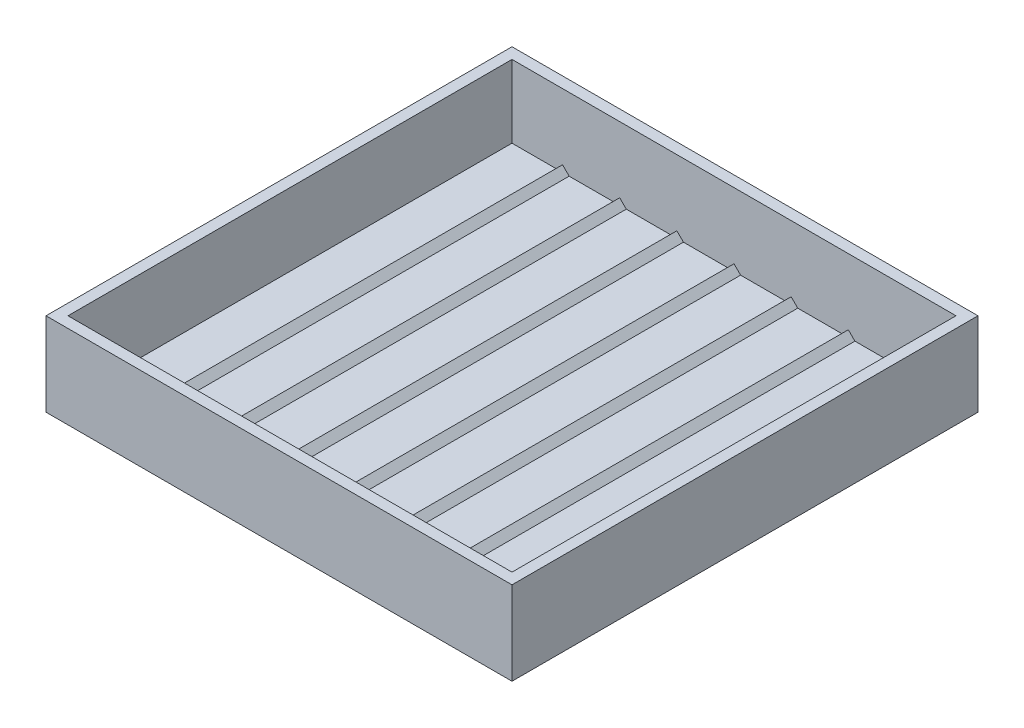
ISO-10303-21;
HEADER;
FILE_DESCRIPTION(('STEP AP214'),'2;1');
FILE_NAME('part.step','',(''),(''),'','','');
FILE_SCHEMA(('AUTOMOTIVE_DESIGN { 1 0 10303 214 1 1 1 1 }'));
ENDSEC;
DATA;
#1=APPLICATION_CONTEXT('core data for automotive mechanical design processes');
#2=APPLICATION_PROTOCOL_DEFINITION('international standard','automotive_design',2000,#1);
#3=PRODUCT_CONTEXT('',#1,'mechanical');
#4=PRODUCT('Part','Part','',(#3));
#5=PRODUCT_RELATED_PRODUCT_CATEGORY('part','',(#4));
#6=PRODUCT_DEFINITION_FORMATION('','',#4);
#7=PRODUCT_DEFINITION_CONTEXT('part definition',#1,'design');
#8=PRODUCT_DEFINITION('design','',#6,#7);
#9=PRODUCT_DEFINITION_SHAPE('','',#8);
#10=(LENGTH_UNIT() NAMED_UNIT(*) SI_UNIT(.MILLI.,.METRE.));
#11=(NAMED_UNIT(*) PLANE_ANGLE_UNIT() SI_UNIT($,.RADIAN.));
#12=(NAMED_UNIT(*) SI_UNIT($,.STERADIAN.) SOLID_ANGLE_UNIT());
#13=UNCERTAINTY_MEASURE_WITH_UNIT(LENGTH_MEASURE(1.E-05),#10,'distance_accuracy_value','');
#14=(GEOMETRIC_REPRESENTATION_CONTEXT(3) GLOBAL_UNCERTAINTY_ASSIGNED_CONTEXT((#13)) GLOBAL_UNIT_ASSIGNED_CONTEXT((#10,
#11,#12)) REPRESENTATION_CONTEXT('',''));
#15=CARTESIAN_POINT('',(0.,0.,0.));
#16=DIRECTION('',(0.,0.,1.));
#17=DIRECTION('',(1.,0.,0.));
#18=AXIS2_PLACEMENT_3D('',#15,#16,#17);
#19=CARTESIAN_POINT('',(0.,0.,0.));
#20=DIRECTION('',(0.,0.,1.));
#21=DIRECTION('',(1.,0.,0.));
#22=AXIS2_PLACEMENT_3D('',#19,#20,#21);
#23=PLANE('',#22);
#24=DIRECTION('',(1.,0.,0.));
#25=VECTOR('',#24,1.);
#26=CARTESIAN_POINT('',(0.,-7.00000000000003,0.));
#27=LINE('',#26,#25);
#28=CARTESIAN_POINT('',(40.5,-7.00000000000001,0.));
#29=VERTEX_POINT('',#28);
#30=CARTESIAN_POINT('',(50.5,-7.,0.));
#31=VERTEX_POINT('',#30);
#32=EDGE_CURVE('E50',#29,#31,#27,.T.);
#33=ORIENTED_EDGE('',*,*,#32,.T.);
#34=DIRECTION('',(0.,1.,0.));
#35=VECTOR('',#34,1.);
#36=CARTESIAN_POINT('',(50.5,0.,0.));
#37=LINE('',#36,#35);
#38=CARTESIAN_POINT('',(50.5,9.50000000000001,0.));
#39=VERTEX_POINT('',#38);
#40=EDGE_CURVE('E385',#31,#39,#37,.T.);
#41=ORIENTED_EDGE('',*,*,#40,.T.);
#42=DIRECTION('',(-1.,0.,0.));
#43=VECTOR('',#42,1.);
#44=CARTESIAN_POINT('',(0.,9.5,0.));
#45=LINE('',#44,#43);
#46=CARTESIAN_POINT('',(-50.5,9.49999999999999,0.));
#47=VERTEX_POINT('',#46);
#48=EDGE_CURVE('E454',#39,#47,#45,.T.);
#49=ORIENTED_EDGE('',*,*,#48,.T.);
#50=DIRECTION('',(0.,1.,0.));
#51=VECTOR('',#50,1.);
#52=CARTESIAN_POINT('',(-50.5,0.,0.));
#53=LINE('',#52,#51);
#54=CARTESIAN_POINT('',(-50.5,-7.00000000000001,0.));
#55=VERTEX_POINT('',#54);
#56=EDGE_CURVE('E382',#55,#47,#53,.T.);
#57=ORIENTED_EDGE('',*,*,#56,.F.);
#58=DIRECTION('',(1.,0.,0.));
#59=VECTOR('',#58,1.);
#60=CARTESIAN_POINT('',(0.,-7.00000000000001,0.));
#61=LINE('',#60,#59);
#62=CARTESIAN_POINT('',(-40.5,-7.00000000000001,0.));
#63=VERTEX_POINT('',#62);
#64=EDGE_CURVE('E380',#55,#63,#61,.T.);
#65=ORIENTED_EDGE('',*,*,#64,.T.);
#66=DIRECTION('',(-0.707106781186546,-0.707106781186549,0.));
#67=VECTOR('',#66,1.);
#68=CARTESIAN_POINT('',(-16.7500000000001,16.75,0.));
#69=LINE('',#68,#67);
#70=CARTESIAN_POINT('',(-39.,-5.50000000000001,0.));
#71=VERTEX_POINT('',#70);
#72=EDGE_CURVE('E377',#71,#63,#69,.T.);
#73=ORIENTED_EDGE('',*,*,#72,.F.);
#74=DIRECTION('',(-0.707106781186549,0.707106781186546,0.));
#75=VECTOR('',#74,1.);
#76=CARTESIAN_POINT('',(-22.2499999999999,-22.25,0.));
#77=LINE('',#76,#75);
#78=CARTESIAN_POINT('',(-37.5,-7.00000000000001,0.));
#79=VERTEX_POINT('',#78);
#80=EDGE_CURVE('E374',#79,#71,#77,.T.);
#81=ORIENTED_EDGE('',*,*,#80,.F.);
#82=DIRECTION('',(1.,0.,0.));
#83=VECTOR('',#82,1.);
#84=CARTESIAN_POINT('',(0.,-7.00000000000001,0.));
#85=LINE('',#84,#83);
#86=CARTESIAN_POINT('',(-27.5,-7.00000000000001,0.));
#87=VERTEX_POINT('',#86);
#88=EDGE_CURVE('E372',#79,#87,#85,.T.);
#89=ORIENTED_EDGE('',*,*,#88,.T.);
#90=DIRECTION('',(-0.707106781186546,-0.707106781186549,0.));
#91=VECTOR('',#90,1.);
#92=CARTESIAN_POINT('',(-10.2500000000001,10.25,0.));
#93=LINE('',#92,#91);
#94=CARTESIAN_POINT('',(-26.,-5.50000000000001,0.));
#95=VERTEX_POINT('',#94);
#96=EDGE_CURVE('E369',#95,#87,#93,.T.);
#97=ORIENTED_EDGE('',*,*,#96,.F.);
#98=DIRECTION('',(-0.707106781186549,0.707106781186546,0.));
#99=VECTOR('',#98,1.);
#100=CARTESIAN_POINT('',(-15.7499999999999,-15.75,0.));
#101=LINE('',#100,#99);
#102=CARTESIAN_POINT('',(-24.5,-7.,0.));
#103=VERTEX_POINT('',#102);
#104=EDGE_CURVE('E366',#103,#95,#101,.T.);
#105=ORIENTED_EDGE('',*,*,#104,.F.);
#106=DIRECTION('',(1.,0.,0.));
#107=VECTOR('',#106,1.);
#108=CARTESIAN_POINT('',(0.,-7.00000000000001,0.));
#109=LINE('',#108,#107);
#110=CARTESIAN_POINT('',(-14.5,-7.00000000000001,0.));
#111=VERTEX_POINT('',#110);
#112=EDGE_CURVE('E364',#103,#111,#109,.T.);
#113=ORIENTED_EDGE('',*,*,#112,.T.);
#114=DIRECTION('',(-0.707106781186546,-0.707106781186549,0.));
#115=VECTOR('',#114,1.);
#116=CARTESIAN_POINT('',(-3.75000000000003,3.75000000000001,0.));
#117=LINE('',#116,#115);
#118=CARTESIAN_POINT('',(-13.,-5.50000000000001,0.));
#119=VERTEX_POINT('',#118);
#120=EDGE_CURVE('E361',#119,#111,#117,.T.);
#121=ORIENTED_EDGE('',*,*,#120,.F.);
#122=DIRECTION('',(-0.707106781186549,0.707106781186546,0.));
#123=VECTOR('',#122,1.);
#124=CARTESIAN_POINT('',(-9.24999999999997,-9.25000000000002,0.));
#125=LINE('',#124,#123);
#126=CARTESIAN_POINT('',(-11.5,-7.00000000000001,0.));
#127=VERTEX_POINT('',#126);
#128=EDGE_CURVE('E358',#127,#119,#125,.T.);
#129=ORIENTED_EDGE('',*,*,#128,.F.);
#130=DIRECTION('',(1.,0.,0.));
#131=VECTOR('',#130,1.);
#132=CARTESIAN_POINT('',(0.,-7.00000000000001,0.));
#133=LINE('',#132,#131);
#134=CARTESIAN_POINT('',(-1.5,-7.00000000000001,0.));
#135=VERTEX_POINT('',#134);
#136=EDGE_CURVE('E356',#127,#135,#133,.T.);
#137=ORIENTED_EDGE('',*,*,#136,.T.);
#138=DIRECTION('',(-0.707106781186546,-0.707106781186549,0.));
#139=VECTOR('',#138,1.);
#140=CARTESIAN_POINT('',(2.75,-2.74999999999999,0.));
#141=LINE('',#140,#139);
#142=CARTESIAN_POINT('',(0.,-5.50000000000001,0.));
#143=VERTEX_POINT('',#142);
#144=EDGE_CURVE('E353',#143,#135,#141,.T.);
#145=ORIENTED_EDGE('',*,*,#144,.F.);
#146=DIRECTION('',(-0.707106781186549,0.707106781186546,0.));
#147=VECTOR('',#146,1.);
#148=CARTESIAN_POINT('',(-2.75,-2.75000000000002,0.));
#149=LINE('',#148,#147);
#150=CARTESIAN_POINT('',(1.5,-7.00000000000001,0.));
#151=VERTEX_POINT('',#150);
#152=EDGE_CURVE('E350',#151,#143,#149,.T.);
#153=ORIENTED_EDGE('',*,*,#152,.F.);
#154=DIRECTION('',(1.,0.,0.));
#155=VECTOR('',#154,1.);
#156=CARTESIAN_POINT('',(0.,-7.00000000000001,0.));
#157=LINE('',#156,#155);
#158=CARTESIAN_POINT('',(11.5,-7.00000000000001,0.));
#159=VERTEX_POINT('',#158);
#160=EDGE_CURVE('E348',#151,#159,#157,.T.);
#161=ORIENTED_EDGE('',*,*,#160,.T.);
#162=DIRECTION('',(-0.707106781186546,-0.707106781186549,0.));
#163=VECTOR('',#162,1.);
#164=CARTESIAN_POINT('',(9.25000000000003,-9.24999999999999,0.));
#165=LINE('',#164,#163);
#166=CARTESIAN_POINT('',(13.,-5.50000000000001,0.));
#167=VERTEX_POINT('',#166);
#168=EDGE_CURVE('E345',#167,#159,#165,.T.);
#169=ORIENTED_EDGE('',*,*,#168,.F.);
#170=DIRECTION('',(-0.707106781186549,0.707106781186546,0.));
#171=VECTOR('',#170,1.);
#172=CARTESIAN_POINT('',(3.74999999999996,3.74999999999998,0.));
#173=LINE('',#172,#171);
#174=CARTESIAN_POINT('',(14.5,-7.00000000000001,0.));
#175=VERTEX_POINT('',#174);
#176=EDGE_CURVE('E342',#175,#167,#173,.T.);
#177=ORIENTED_EDGE('',*,*,#176,.F.);
#178=DIRECTION('',(1.,0.,0.));
#179=VECTOR('',#178,1.);
#180=CARTESIAN_POINT('',(0.,-7.00000000000001,0.));
#181=LINE('',#180,#179);
#182=CARTESIAN_POINT('',(24.5,-7.00000000000001,0.));
#183=VERTEX_POINT('',#182);
#184=EDGE_CURVE('E340',#175,#183,#181,.T.);
#185=ORIENTED_EDGE('',*,*,#184,.T.);
#186=DIRECTION('',(-0.707106781186546,-0.707106781186549,0.));
#187=VECTOR('',#186,1.);
#188=CARTESIAN_POINT('',(15.7500000000001,-15.75,0.));
#189=LINE('',#188,#187);
#190=CARTESIAN_POINT('',(26.,-5.50000000000001,0.));
#191=VERTEX_POINT('',#190);
#192=EDGE_CURVE('E337',#191,#183,#189,.T.);
#193=ORIENTED_EDGE('',*,*,#192,.F.);
#194=DIRECTION('',(-0.707106781186549,0.707106781186546,0.));
#195=VECTOR('',#194,1.);
#196=CARTESIAN_POINT('',(10.2499999999999,10.25,0.));
#197=LINE('',#196,#195);
#198=CARTESIAN_POINT('',(27.5,-7.00000000000001,0.));
#199=VERTEX_POINT('',#198);
#200=EDGE_CURVE('E334',#199,#191,#197,.T.);
#201=ORIENTED_EDGE('',*,*,#200,.F.);
#202=DIRECTION('',(1.,0.,0.));
#203=VECTOR('',#202,1.);
#204=CARTESIAN_POINT('',(0.,-7.00000000000001,0.));
#205=LINE('',#204,#203);
#206=CARTESIAN_POINT('',(37.5,-7.00000000000001,0.));
#207=VERTEX_POINT('',#206);
#208=EDGE_CURVE('E332',#199,#207,#205,.T.);
#209=ORIENTED_EDGE('',*,*,#208,.T.);
#210=DIRECTION('',(-0.707106781186546,-0.707106781186549,0.));
#211=VECTOR('',#210,1.);
#212=CARTESIAN_POINT('',(22.2500000000001,-22.25,0.));
#213=LINE('',#212,#211);
#214=CARTESIAN_POINT('',(39.,-5.5,0.));
#215=VERTEX_POINT('',#214);
#216=EDGE_CURVE('E232',#215,#207,#213,.T.);
#217=ORIENTED_EDGE('',*,*,#216,.F.);
#218=DIRECTION('',(-0.707106781186549,0.707106781186546,0.));
#219=VECTOR('',#218,1.);
#220=CARTESIAN_POINT('',(16.7499999999999,16.75,0.));
#221=LINE('',#220,#219);
#222=EDGE_CURVE('E55',#29,#215,#221,.T.);
#223=ORIENTED_EDGE('',*,*,#222,.F.);
#224=EDGE_LOOP('',(#33,#41,#49,#57,#65,#73,#81,#89,#97,#105,#113,#121,#129,#137,#145,#153,#161,
#169,#177,#185,#193,#201,#209,#217,#223));
#225=FACE_BOUND('',#224,.T.);
#226=ADVANCED_FACE('F33',(#225),#23,.T.);
#227=CARTESIAN_POINT('',(53.,0.,-2.5));
#228=DIRECTION('',(1.,0.,0.));
#229=DIRECTION('',(0.,0.,-1.));
#230=AXIS2_PLACEMENT_3D('',#227,#228,#229);
#231=PLANE('',#230);
#232=DIRECTION('',(0.,0.,1.));
#233=VECTOR('',#232,1.);
#234=CARTESIAN_POINT('',(53.,9.50000000000001,-2.5));
#235=LINE('',#234,#233);
#236=CARTESIAN_POINT('',(53.,9.50000000000001,-2.5));
#237=VERTEX_POINT('',#236);
#238=CARTESIAN_POINT('',(53.,9.50000000000001,103.5));
#239=VERTEX_POINT('',#238);
#240=EDGE_CURVE('E37',#237,#239,#235,.T.);
#241=ORIENTED_EDGE('',*,*,#240,.T.);
#242=DIRECTION('',(0.,1.,0.));
#243=VECTOR('',#242,1.);
#244=CARTESIAN_POINT('',(53.,0.,103.5));
#245=LINE('',#244,#243);
#246=CARTESIAN_POINT('',(53.,-9.49999999999999,103.5));
#247=VERTEX_POINT('',#246);
#248=EDGE_CURVE('E316',#247,#239,#245,.T.);
#249=ORIENTED_EDGE('',*,*,#248,.F.);
#250=DIRECTION('',(0.,0.,1.));
#251=VECTOR('',#250,1.);
#252=CARTESIAN_POINT('',(53.,-9.49999999999999,-2.5));
#253=LINE('',#252,#251);
#254=CARTESIAN_POINT('',(53.,-9.49999999999999,-2.5));
#255=VERTEX_POINT('',#254);
#256=EDGE_CURVE('E11',#255,#247,#253,.T.);
#257=ORIENTED_EDGE('',*,*,#256,.F.);
#258=DIRECTION('',(0.,1.,0.));
#259=VECTOR('',#258,1.);
#260=CARTESIAN_POINT('',(53.,0.,-2.5));
#261=LINE('',#260,#259);
#262=EDGE_CURVE('E455',#255,#237,#261,.T.);
#263=ORIENTED_EDGE('',*,*,#262,.T.);
#264=EDGE_LOOP('',(#241,#249,#257,#263));
#265=FACE_BOUND('',#264,.T.);
#266=ADVANCED_FACE('F35',(#265),#231,.T.);
#267=CARTESIAN_POINT('',(0.,-9.5,-2.5));
#268=DIRECTION('',(0.,1.,0.));
#269=DIRECTION('',(-1.,0.,0.));
#270=AXIS2_PLACEMENT_3D('',#267,#268,#269);
#271=PLANE('',#270);
#272=ORIENTED_EDGE('',*,*,#256,.T.);
#273=DIRECTION('',(-1.,0.,0.));
#274=VECTOR('',#273,1.);
#275=CARTESIAN_POINT('',(0.,-9.5,103.5));
#276=LINE('',#275,#274);
#277=CARTESIAN_POINT('',(-53.,-9.50000000000001,103.5));
#278=VERTEX_POINT('',#277);
#279=EDGE_CURVE('E325',#247,#278,#276,.T.);
#280=ORIENTED_EDGE('',*,*,#279,.T.);
#281=DIRECTION('',(0.,0.,1.));
#282=VECTOR('',#281,1.);
#283=CARTESIAN_POINT('',(-53.,-9.50000000000001,-2.5));
#284=LINE('',#283,#282);
#285=CARTESIAN_POINT('',(-53.,-9.50000000000001,-2.5));
#286=VERTEX_POINT('',#285);
#287=EDGE_CURVE('E42',#286,#278,#284,.T.);
#288=ORIENTED_EDGE('',*,*,#287,.F.);
#289=DIRECTION('',(-1.,0.,0.));
#290=VECTOR('',#289,1.);
#291=CARTESIAN_POINT('',(0.,-9.5,-2.5));
#292=LINE('',#291,#290);
#293=EDGE_CURVE('E463',#255,#286,#292,.T.);
#294=ORIENTED_EDGE('',*,*,#293,.F.);
#295=EDGE_LOOP('',(#272,#280,#288,#294));
#296=FACE_BOUND('',#295,.T.);
#297=ADVANCED_FACE('F482',(#296),#271,.F.);
#298=CARTESIAN_POINT('',(-53.,0.,-2.5));
#299=DIRECTION('',(1.,0.,0.));
#300=DIRECTION('',(0.,0.,-1.));
#301=AXIS2_PLACEMENT_3D('',#298,#299,#300);
#302=PLANE('',#301);
#303=ORIENTED_EDGE('',*,*,#287,.T.);
#304=DIRECTION('',(0.,1.,0.));
#305=VECTOR('',#304,1.);
#306=CARTESIAN_POINT('',(-53.,0.,103.5));
#307=LINE('',#306,#305);
#308=CARTESIAN_POINT('',(-53.,9.49999999999999,103.5));
#309=VERTEX_POINT('',#308);
#310=EDGE_CURVE('E322',#278,#309,#307,.T.);
#311=ORIENTED_EDGE('',*,*,#310,.T.);
#312=DIRECTION('',(0.,0.,1.));
#313=VECTOR('',#312,1.);
#314=CARTESIAN_POINT('',(-53.,9.49999999999999,-2.5));
#315=LINE('',#314,#313);
#316=CARTESIAN_POINT('',(-53.,9.49999999999999,-2.5));
#317=VERTEX_POINT('',#316);
#318=EDGE_CURVE('E466',#317,#309,#315,.T.);
#319=ORIENTED_EDGE('',*,*,#318,.F.);
#320=DIRECTION('',(0.,1.,0.));
#321=VECTOR('',#320,1.);
#322=CARTESIAN_POINT('',(-53.,0.,-2.5));
#323=LINE('',#322,#321);
#324=EDGE_CURVE('E461',#286,#317,#323,.T.);
#325=ORIENTED_EDGE('',*,*,#324,.F.);
#326=EDGE_LOOP('',(#303,#311,#319,#325));
#327=FACE_BOUND('',#326,.T.);
#328=ADVANCED_FACE('F488',(#327),#302,.F.);
#329=CARTESIAN_POINT('',(0.,9.5,-2.5));
#330=DIRECTION('',(0.,1.,0.));
#331=DIRECTION('',(-1.,0.,0.));
#332=AXIS2_PLACEMENT_3D('',#329,#330,#331);
#333=PLANE('',#332);
#334=ORIENTED_EDGE('',*,*,#318,.T.);
#335=DIRECTION('',(-1.,0.,0.));
#336=VECTOR('',#335,1.);
#337=CARTESIAN_POINT('',(0.,9.5,103.5));
#338=LINE('',#337,#336);
#339=EDGE_CURVE('E319',#239,#309,#338,.T.);
#340=ORIENTED_EDGE('',*,*,#339,.F.);
#341=ORIENTED_EDGE('',*,*,#240,.F.);
#342=DIRECTION('',(-1.,0.,0.));
#343=VECTOR('',#342,1.);
#344=CARTESIAN_POINT('',(0.,9.5,-2.5));
#345=LINE('',#344,#343);
#346=EDGE_CURVE('E458',#237,#317,#345,.T.);
#347=ORIENTED_EDGE('',*,*,#346,.T.);
#348=EDGE_LOOP('',(#334,#340,#341,#347));
#349=FACE_BOUND('',#348,.T.);
#350=ORIENTED_EDGE('',*,*,#48,.F.);
#351=DIRECTION('',(0.,0.,-1.));
#352=VECTOR('',#351,1.);
#353=CARTESIAN_POINT('',(50.5,9.50000000000001,50.5));
#354=LINE('',#353,#352);
#355=CARTESIAN_POINT('',(50.5,9.50000000000001,101.));
#356=VERTEX_POINT('',#355);
#357=EDGE_CURVE('E392',#356,#39,#354,.T.);
#358=ORIENTED_EDGE('',*,*,#357,.F.);
#359=DIRECTION('',(-1.,0.,0.));
#360=VECTOR('',#359,1.);
#361=CARTESIAN_POINT('',(0.,9.5,101.));
#362=LINE('',#361,#360);
#363=CARTESIAN_POINT('',(-50.5,9.49999999999999,101.));
#364=VERTEX_POINT('',#363);
#365=EDGE_CURVE('E315',#356,#364,#362,.T.);
#366=ORIENTED_EDGE('',*,*,#365,.T.);
#367=DIRECTION('',(0.,0.,-1.));
#368=VECTOR('',#367,1.);
#369=CARTESIAN_POINT('',(-50.5,9.49999999999999,50.5));
#370=LINE('',#369,#368);
#371=EDGE_CURVE('E395',#364,#47,#370,.T.);
#372=ORIENTED_EDGE('',*,*,#371,.T.);
#373=EDGE_LOOP('',(#350,#358,#366,#372));
#374=FACE_BOUND('',#373,.T.);
#375=ADVANCED_FACE('F474',(#349,#374),#333,.T.);
#376=CARTESIAN_POINT('',(0.,0.,-2.5));
#377=DIRECTION('',(0.,0.,1.));
#378=DIRECTION('',(1.,0.,0.));
#379=AXIS2_PLACEMENT_3D('',#376,#377,#378);
#380=PLANE('',#379);
#381=ORIENTED_EDGE('',*,*,#262,.F.);
#382=ORIENTED_EDGE('',*,*,#293,.T.);
#383=ORIENTED_EDGE('',*,*,#324,.T.);
#384=ORIENTED_EDGE('',*,*,#346,.F.);
#385=EDGE_LOOP('',(#381,#382,#383,#384));
#386=FACE_BOUND('',#385,.T.);
#387=ADVANCED_FACE('F486',(#386),#380,.F.);
#388=CARTESIAN_POINT('',(16.7499999999999,16.75,50.5));
#389=DIRECTION('',(-0.707106781186546,-0.707106781186549,0.));
#390=DIRECTION('',(0.707106781186549,-0.707106781186546,0.));
#391=AXIS2_PLACEMENT_3D('',#388,#389,#390);
#392=PLANE('',#391);
#393=ORIENTED_EDGE('',*,*,#222,.T.);
#394=DIRECTION('',(0.,0.,-1.));
#395=VECTOR('',#394,1.);
#396=CARTESIAN_POINT('',(39.,-5.5,50.5));
#397=LINE('',#396,#395);
#398=CARTESIAN_POINT('',(39.,-5.5,101.));
#399=VERTEX_POINT('',#398);
#400=EDGE_CURVE('E235',#399,#215,#397,.T.);
#401=ORIENTED_EDGE('',*,*,#400,.F.);
#402=DIRECTION('',(-0.707106781186549,0.707106781186546,0.));
#403=VECTOR('',#402,1.);
#404=CARTESIAN_POINT('',(16.7499999999999,16.75,101.));
#405=LINE('',#404,#403);
#406=CARTESIAN_POINT('',(40.5,-7.00000000000001,101.));
#407=VERTEX_POINT('',#406);
#408=EDGE_CURVE('E250',#407,#399,#405,.T.);
#409=ORIENTED_EDGE('',*,*,#408,.F.);
#410=DIRECTION('',(0.,0.,-1.));
#411=VECTOR('',#410,1.);
#412=CARTESIAN_POINT('',(40.5,-7.00000000000001,50.5));
#413=LINE('',#412,#411);
#414=EDGE_CURVE('E388',#407,#29,#413,.T.);
#415=ORIENTED_EDGE('',*,*,#414,.T.);
#416=EDGE_LOOP('',(#393,#401,#409,#415));
#417=FACE_BOUND('',#416,.T.);
#418=ADVANCED_FACE('F504',(#417),#392,.F.);
#419=CARTESIAN_POINT('',(22.2500000000001,-22.25,50.5));
#420=DIRECTION('',(0.707106781186549,-0.707106781186546,0.));
#421=DIRECTION('',(0.707106781186546,0.707106781186549,0.));
#422=AXIS2_PLACEMENT_3D('',#419,#420,#421);
#423=PLANE('',#422);
#424=ORIENTED_EDGE('',*,*,#216,.T.);
#425=DIRECTION('',(0.,0.,-1.));
#426=VECTOR('',#425,1.);
#427=CARTESIAN_POINT('',(37.5,-7.00000000000001,50.5));
#428=LINE('',#427,#426);
#429=CARTESIAN_POINT('',(37.5,-7.00000000000001,101.));
#430=VERTEX_POINT('',#429);
#431=EDGE_CURVE('E225',#430,#207,#428,.T.);
#432=ORIENTED_EDGE('',*,*,#431,.F.);
#433=DIRECTION('',(-0.707106781186546,-0.707106781186549,0.));
#434=VECTOR('',#433,1.);
#435=CARTESIAN_POINT('',(22.2500000000001,-22.25,101.));
#436=LINE('',#435,#434);
#437=EDGE_CURVE('E230',#399,#430,#436,.T.);
#438=ORIENTED_EDGE('',*,*,#437,.F.);
#439=ORIENTED_EDGE('',*,*,#400,.T.);
#440=EDGE_LOOP('',(#424,#432,#438,#439));
#441=FACE_BOUND('',#440,.T.);
#442=ADVANCED_FACE('F227',(#441),#423,.F.);
#443=CARTESIAN_POINT('',(0.,-7.00000000000001,50.5));
#444=DIRECTION('',(0.,1.,0.));
#445=DIRECTION('',(-1.,0.,0.));
#446=AXIS2_PLACEMENT_3D('',#443,#444,#445);
#447=PLANE('',#446);
#448=ORIENTED_EDGE('',*,*,#208,.F.);
#449=DIRECTION('',(0.,0.,-1.));
#450=VECTOR('',#449,1.);
#451=CARTESIAN_POINT('',(27.5,-7.00000000000001,50.5));
#452=LINE('',#451,#450);
#453=CARTESIAN_POINT('',(27.5,-7.00000000000001,101.));
#454=VERTEX_POINT('',#453);
#455=EDGE_CURVE('E236',#454,#199,#452,.T.);
#456=ORIENTED_EDGE('',*,*,#455,.F.);
#457=DIRECTION('',(1.,0.,0.));
#458=VECTOR('',#457,1.);
#459=CARTESIAN_POINT('',(0.,-7.00000000000001,101.));
#460=LINE('',#459,#458);
#461=EDGE_CURVE('E239',#454,#430,#460,.T.);
#462=ORIENTED_EDGE('',*,*,#461,.T.);
#463=ORIENTED_EDGE('',*,*,#431,.T.);
#464=EDGE_LOOP('',(#448,#456,#462,#463));
#465=FACE_BOUND('',#464,.T.);
#466=ADVANCED_FACE('F240',(#465),#447,.T.);
#467=CARTESIAN_POINT('',(10.2499999999999,10.25,50.5));
#468=DIRECTION('',(-0.707106781186546,-0.707106781186549,0.));
#469=DIRECTION('',(0.707106781186549,-0.707106781186546,0.));
#470=AXIS2_PLACEMENT_3D('',#467,#468,#469);
#471=PLANE('',#470);
#472=ORIENTED_EDGE('',*,*,#200,.T.);
#473=DIRECTION('',(0.,0.,-1.));
#474=VECTOR('',#473,1.);
#475=CARTESIAN_POINT('',(26.,-5.50000000000001,50.5));
#476=LINE('',#475,#474);
#477=CARTESIAN_POINT('',(26.,-5.50000000000001,101.));
#478=VERTEX_POINT('',#477);
#479=EDGE_CURVE('E449',#478,#191,#476,.T.);
#480=ORIENTED_EDGE('',*,*,#479,.F.);
#481=DIRECTION('',(-0.707106781186549,0.707106781186546,0.));
#482=VECTOR('',#481,1.);
#483=CARTESIAN_POINT('',(10.2499999999999,10.25,101.));
#484=LINE('',#483,#482);
#485=EDGE_CURVE('E245',#454,#478,#484,.T.);
#486=ORIENTED_EDGE('',*,*,#485,.F.);
#487=ORIENTED_EDGE('',*,*,#455,.T.);
#488=EDGE_LOOP('',(#472,#480,#486,#487));
#489=FACE_BOUND('',#488,.T.);
#490=ADVANCED_FACE('F512',(#489),#471,.F.);
#491=CARTESIAN_POINT('',(15.7500000000001,-15.75,50.5));
#492=DIRECTION('',(0.707106781186549,-0.707106781186546,0.));
#493=DIRECTION('',(0.707106781186546,0.707106781186549,0.));
#494=AXIS2_PLACEMENT_3D('',#491,#492,#493);
#495=PLANE('',#494);
#496=ORIENTED_EDGE('',*,*,#192,.T.);
#497=DIRECTION('',(0.,0.,-1.));
#498=VECTOR('',#497,1.);
#499=CARTESIAN_POINT('',(24.5,-7.00000000000001,50.5));
#500=LINE('',#499,#498);
#501=CARTESIAN_POINT('',(24.5,-7.00000000000001,101.));
#502=VERTEX_POINT('',#501);
#503=EDGE_CURVE('E446',#502,#183,#500,.T.);
#504=ORIENTED_EDGE('',*,*,#503,.F.);
#505=DIRECTION('',(-0.707106781186546,-0.707106781186549,0.));
#506=VECTOR('',#505,1.);
#507=CARTESIAN_POINT('',(15.7500000000001,-15.75,101.));
#508=LINE('',#507,#506);
#509=EDGE_CURVE('E255',#478,#502,#508,.T.);
#510=ORIENTED_EDGE('',*,*,#509,.F.);
#511=ORIENTED_EDGE('',*,*,#479,.T.);
#512=EDGE_LOOP('',(#496,#504,#510,#511));
#513=FACE_BOUND('',#512,.T.);
#514=ADVANCED_FACE('F515',(#513),#495,.F.);
#515=CARTESIAN_POINT('',(0.,-7.00000000000001,50.5));
#516=DIRECTION('',(0.,1.,0.));
#517=DIRECTION('',(0.,0.,1.));
#518=AXIS2_PLACEMENT_3D('',#515,#516,#517);
#519=PLANE('',#518);
#520=ORIENTED_EDGE('',*,*,#184,.F.);
#521=DIRECTION('',(0.,0.,-1.));
#522=VECTOR('',#521,1.);
#523=CARTESIAN_POINT('',(14.5,-7.00000000000001,50.5));
#524=LINE('',#523,#522);
#525=CARTESIAN_POINT('',(14.5,-7.00000000000001,101.));
#526=VERTEX_POINT('',#525);
#527=EDGE_CURVE('E443',#526,#175,#524,.T.);
#528=ORIENTED_EDGE('',*,*,#527,.F.);
#529=DIRECTION('',(1.,0.,0.));
#530=VECTOR('',#529,1.);
#531=CARTESIAN_POINT('',(0.,-7.00000000000001,101.));
#532=LINE('',#531,#530);
#533=EDGE_CURVE('E258',#526,#502,#532,.T.);
#534=ORIENTED_EDGE('',*,*,#533,.T.);
#535=ORIENTED_EDGE('',*,*,#503,.T.);
#536=EDGE_LOOP('',(#520,#528,#534,#535));
#537=FACE_BOUND('',#536,.T.);
#538=ADVANCED_FACE('F519',(#537),#519,.T.);
#539=CARTESIAN_POINT('',(3.74999999999996,3.74999999999998,50.5));
#540=DIRECTION('',(-0.707106781186546,-0.707106781186549,0.));
#541=DIRECTION('',(0.707106781186549,-0.707106781186546,0.));
#542=AXIS2_PLACEMENT_3D('',#539,#540,#541);
#543=PLANE('',#542);
#544=ORIENTED_EDGE('',*,*,#176,.T.);
#545=DIRECTION('',(0.,0.,-1.));
#546=VECTOR('',#545,1.);
#547=CARTESIAN_POINT('',(13.,-5.50000000000001,50.5));
#548=LINE('',#547,#546);
#549=CARTESIAN_POINT('',(13.,-5.50000000000001,101.));
#550=VERTEX_POINT('',#549);
#551=EDGE_CURVE('E440',#550,#167,#548,.T.);
#552=ORIENTED_EDGE('',*,*,#551,.F.);
#553=DIRECTION('',(-0.707106781186549,0.707106781186546,0.));
#554=VECTOR('',#553,1.);
#555=CARTESIAN_POINT('',(3.74999999999996,3.74999999999998,101.));
#556=LINE('',#555,#554);
#557=EDGE_CURVE('E261',#526,#550,#556,.T.);
#558=ORIENTED_EDGE('',*,*,#557,.F.);
#559=ORIENTED_EDGE('',*,*,#527,.T.);
#560=EDGE_LOOP('',(#544,#552,#558,#559));
#561=FACE_BOUND('',#560,.T.);
#562=ADVANCED_FACE('F523',(#561),#543,.F.);
#563=CARTESIAN_POINT('',(9.25000000000003,-9.24999999999999,50.5));
#564=DIRECTION('',(0.707106781186549,-0.707106781186546,0.));
#565=DIRECTION('',(0.707106781186546,0.707106781186549,0.));
#566=AXIS2_PLACEMENT_3D('',#563,#564,#565);
#567=PLANE('',#566);
#568=ORIENTED_EDGE('',*,*,#168,.T.);
#569=DIRECTION('',(0.,0.,-1.));
#570=VECTOR('',#569,1.);
#571=CARTESIAN_POINT('',(11.5,-7.00000000000001,50.5));
#572=LINE('',#571,#570);
#573=CARTESIAN_POINT('',(11.5,-7.00000000000001,101.));
#574=VERTEX_POINT('',#573);
#575=EDGE_CURVE('E437',#574,#159,#572,.T.);
#576=ORIENTED_EDGE('',*,*,#575,.F.);
#577=DIRECTION('',(-0.707106781186546,-0.707106781186549,0.));
#578=VECTOR('',#577,1.);
#579=CARTESIAN_POINT('',(9.25000000000003,-9.24999999999999,101.));
#580=LINE('',#579,#578);
#581=EDGE_CURVE('E264',#550,#574,#580,.T.);
#582=ORIENTED_EDGE('',*,*,#581,.F.);
#583=ORIENTED_EDGE('',*,*,#551,.T.);
#584=EDGE_LOOP('',(#568,#576,#582,#583));
#585=FACE_BOUND('',#584,.T.);
#586=ADVANCED_FACE('F527',(#585),#567,.F.);
#587=CARTESIAN_POINT('',(0.,-7.00000000000001,50.5));
#588=DIRECTION('',(0.,1.,0.));
#589=DIRECTION('',(0.,0.,1.));
#590=AXIS2_PLACEMENT_3D('',#587,#588,#589);
#591=PLANE('',#590);
#592=ORIENTED_EDGE('',*,*,#160,.F.);
#593=DIRECTION('',(0.,0.,-1.));
#594=VECTOR('',#593,1.);
#595=CARTESIAN_POINT('',(1.5,-7.00000000000001,50.5));
#596=LINE('',#595,#594);
#597=CARTESIAN_POINT('',(1.5,-7.00000000000001,101.));
#598=VERTEX_POINT('',#597);
#599=EDGE_CURVE('E434',#598,#151,#596,.T.);
#600=ORIENTED_EDGE('',*,*,#599,.F.);
#601=DIRECTION('',(1.,0.,0.));
#602=VECTOR('',#601,1.);
#603=CARTESIAN_POINT('',(0.,-7.00000000000001,101.));
#604=LINE('',#603,#602);
#605=EDGE_CURVE('E267',#598,#574,#604,.T.);
#606=ORIENTED_EDGE('',*,*,#605,.T.);
#607=ORIENTED_EDGE('',*,*,#575,.T.);
#608=EDGE_LOOP('',(#592,#600,#606,#607));
#609=FACE_BOUND('',#608,.T.);
#610=ADVANCED_FACE('F531',(#609),#591,.T.);
#611=CARTESIAN_POINT('',(-2.75,-2.75000000000002,50.5));
#612=DIRECTION('',(-0.707106781186546,-0.707106781186549,0.));
#613=DIRECTION('',(0.707106781186549,-0.707106781186546,0.));
#614=AXIS2_PLACEMENT_3D('',#611,#612,#613);
#615=PLANE('',#614);
#616=ORIENTED_EDGE('',*,*,#152,.T.);
#617=DIRECTION('',(0.,0.,-1.));
#618=VECTOR('',#617,1.);
#619=CARTESIAN_POINT('',(0.,-5.50000000000001,50.5));
#620=LINE('',#619,#618);
#621=CARTESIAN_POINT('',(0.,-5.50000000000001,101.));
#622=VERTEX_POINT('',#621);
#623=EDGE_CURVE('E431',#622,#143,#620,.T.);
#624=ORIENTED_EDGE('',*,*,#623,.F.);
#625=DIRECTION('',(-0.707106781186549,0.707106781186546,0.));
#626=VECTOR('',#625,1.);
#627=CARTESIAN_POINT('',(-2.75,-2.75000000000002,101.));
#628=LINE('',#627,#626);
#629=EDGE_CURVE('E270',#598,#622,#628,.T.);
#630=ORIENTED_EDGE('',*,*,#629,.F.);
#631=ORIENTED_EDGE('',*,*,#599,.T.);
#632=EDGE_LOOP('',(#616,#624,#630,#631));
#633=FACE_BOUND('',#632,.T.);
#634=ADVANCED_FACE('F535',(#633),#615,.F.);
#635=CARTESIAN_POINT('',(2.75,-2.74999999999999,50.5));
#636=DIRECTION('',(0.707106781186549,-0.707106781186546,0.));
#637=DIRECTION('',(0.707106781186546,0.707106781186549,0.));
#638=AXIS2_PLACEMENT_3D('',#635,#636,#637);
#639=PLANE('',#638);
#640=ORIENTED_EDGE('',*,*,#144,.T.);
#641=DIRECTION('',(0.,0.,-1.));
#642=VECTOR('',#641,1.);
#643=CARTESIAN_POINT('',(-1.5,-7.00000000000001,50.5));
#644=LINE('',#643,#642);
#645=CARTESIAN_POINT('',(-1.5,-7.00000000000001,101.));
#646=VERTEX_POINT('',#645);
#647=EDGE_CURVE('E428',#646,#135,#644,.T.);
#648=ORIENTED_EDGE('',*,*,#647,.F.);
#649=DIRECTION('',(-0.707106781186546,-0.707106781186549,0.));
#650=VECTOR('',#649,1.);
#651=CARTESIAN_POINT('',(2.75,-2.74999999999999,101.));
#652=LINE('',#651,#650);
#653=EDGE_CURVE('E273',#622,#646,#652,.T.);
#654=ORIENTED_EDGE('',*,*,#653,.F.);
#655=ORIENTED_EDGE('',*,*,#623,.T.);
#656=EDGE_LOOP('',(#640,#648,#654,#655));
#657=FACE_BOUND('',#656,.T.);
#658=ADVANCED_FACE('F539',(#657),#639,.F.);
#659=CARTESIAN_POINT('',(0.,-7.00000000000001,50.5));
#660=DIRECTION('',(0.,1.,0.));
#661=DIRECTION('',(0.,0.,1.));
#662=AXIS2_PLACEMENT_3D('',#659,#660,#661);
#663=PLANE('',#662);
#664=ORIENTED_EDGE('',*,*,#136,.F.);
#665=DIRECTION('',(0.,0.,-1.));
#666=VECTOR('',#665,1.);
#667=CARTESIAN_POINT('',(-11.5,-7.00000000000001,50.5));
#668=LINE('',#667,#666);
#669=CARTESIAN_POINT('',(-11.5,-7.00000000000001,101.));
#670=VERTEX_POINT('',#669);
#671=EDGE_CURVE('E425',#670,#127,#668,.T.);
#672=ORIENTED_EDGE('',*,*,#671,.F.);
#673=DIRECTION('',(1.,0.,0.));
#674=VECTOR('',#673,1.);
#675=CARTESIAN_POINT('',(0.,-7.00000000000001,101.));
#676=LINE('',#675,#674);
#677=EDGE_CURVE('E276',#670,#646,#676,.T.);
#678=ORIENTED_EDGE('',*,*,#677,.T.);
#679=ORIENTED_EDGE('',*,*,#647,.T.);
#680=EDGE_LOOP('',(#664,#672,#678,#679));
#681=FACE_BOUND('',#680,.T.);
#682=ADVANCED_FACE('F543',(#681),#663,.T.);
#683=CARTESIAN_POINT('',(-9.24999999999997,-9.25000000000002,50.5));
#684=DIRECTION('',(-0.707106781186546,-0.707106781186549,0.));
#685=DIRECTION('',(0.707106781186549,-0.707106781186546,0.));
#686=AXIS2_PLACEMENT_3D('',#683,#684,#685);
#687=PLANE('',#686);
#688=ORIENTED_EDGE('',*,*,#128,.T.);
#689=DIRECTION('',(0.,0.,-1.));
#690=VECTOR('',#689,1.);
#691=CARTESIAN_POINT('',(-13.,-5.50000000000001,50.5));
#692=LINE('',#691,#690);
#693=CARTESIAN_POINT('',(-13.,-5.50000000000001,101.));
#694=VERTEX_POINT('',#693);
#695=EDGE_CURVE('E422',#694,#119,#692,.T.);
#696=ORIENTED_EDGE('',*,*,#695,.F.);
#697=DIRECTION('',(-0.707106781186549,0.707106781186546,0.));
#698=VECTOR('',#697,1.);
#699=CARTESIAN_POINT('',(-9.24999999999997,-9.25000000000002,101.));
#700=LINE('',#699,#698);
#701=EDGE_CURVE('E279',#670,#694,#700,.T.);
#702=ORIENTED_EDGE('',*,*,#701,.F.);
#703=ORIENTED_EDGE('',*,*,#671,.T.);
#704=EDGE_LOOP('',(#688,#696,#702,#703));
#705=FACE_BOUND('',#704,.T.);
#706=ADVANCED_FACE('F547',(#705),#687,.F.);
#707=CARTESIAN_POINT('',(-3.75000000000003,3.75000000000001,50.5));
#708=DIRECTION('',(0.707106781186549,-0.707106781186546,0.));
#709=DIRECTION('',(0.707106781186546,0.707106781186549,0.));
#710=AXIS2_PLACEMENT_3D('',#707,#708,#709);
#711=PLANE('',#710);
#712=ORIENTED_EDGE('',*,*,#120,.T.);
#713=DIRECTION('',(0.,0.,-1.));
#714=VECTOR('',#713,1.);
#715=CARTESIAN_POINT('',(-14.5,-7.00000000000001,50.5));
#716=LINE('',#715,#714);
#717=CARTESIAN_POINT('',(-14.5,-7.00000000000001,101.));
#718=VERTEX_POINT('',#717);
#719=EDGE_CURVE('E419',#718,#111,#716,.T.);
#720=ORIENTED_EDGE('',*,*,#719,.F.);
#721=DIRECTION('',(-0.707106781186546,-0.707106781186549,0.));
#722=VECTOR('',#721,1.);
#723=CARTESIAN_POINT('',(-3.75000000000003,3.75000000000001,101.));
#724=LINE('',#723,#722);
#725=EDGE_CURVE('E282',#694,#718,#724,.T.);
#726=ORIENTED_EDGE('',*,*,#725,.F.);
#727=ORIENTED_EDGE('',*,*,#695,.T.);
#728=EDGE_LOOP('',(#712,#720,#726,#727));
#729=FACE_BOUND('',#728,.T.);
#730=ADVANCED_FACE('F551',(#729),#711,.F.);
#731=CARTESIAN_POINT('',(0.,-7.00000000000001,50.5));
#732=DIRECTION('',(0.,1.,0.));
#733=DIRECTION('',(0.,0.,1.));
#734=AXIS2_PLACEMENT_3D('',#731,#732,#733);
#735=PLANE('',#734);
#736=ORIENTED_EDGE('',*,*,#112,.F.);
#737=DIRECTION('',(0.,0.,-1.));
#738=VECTOR('',#737,1.);
#739=CARTESIAN_POINT('',(-24.5,-7.,50.5));
#740=LINE('',#739,#738);
#741=CARTESIAN_POINT('',(-24.5,-7.,101.));
#742=VERTEX_POINT('',#741);
#743=EDGE_CURVE('E416',#742,#103,#740,.T.);
#744=ORIENTED_EDGE('',*,*,#743,.F.);
#745=DIRECTION('',(1.,0.,0.));
#746=VECTOR('',#745,1.);
#747=CARTESIAN_POINT('',(0.,-7.00000000000001,101.));
#748=LINE('',#747,#746);
#749=EDGE_CURVE('E285',#742,#718,#748,.T.);
#750=ORIENTED_EDGE('',*,*,#749,.T.);
#751=ORIENTED_EDGE('',*,*,#719,.T.);
#752=EDGE_LOOP('',(#736,#744,#750,#751));
#753=FACE_BOUND('',#752,.T.);
#754=ADVANCED_FACE('F555',(#753),#735,.T.);
#755=CARTESIAN_POINT('',(-15.7499999999999,-15.75,50.5));
#756=DIRECTION('',(-0.707106781186546,-0.707106781186549,0.));
#757=DIRECTION('',(0.707106781186549,-0.707106781186546,0.));
#758=AXIS2_PLACEMENT_3D('',#755,#756,#757);
#759=PLANE('',#758);
#760=ORIENTED_EDGE('',*,*,#104,.T.);
#761=DIRECTION('',(0.,0.,-1.));
#762=VECTOR('',#761,1.);
#763=CARTESIAN_POINT('',(-26.,-5.50000000000001,50.5));
#764=LINE('',#763,#762);
#765=CARTESIAN_POINT('',(-26.,-5.50000000000001,101.));
#766=VERTEX_POINT('',#765);
#767=EDGE_CURVE('E413',#766,#95,#764,.T.);
#768=ORIENTED_EDGE('',*,*,#767,.F.);
#769=DIRECTION('',(-0.707106781186549,0.707106781186546,0.));
#770=VECTOR('',#769,1.);
#771=CARTESIAN_POINT('',(-15.7499999999999,-15.75,101.));
#772=LINE('',#771,#770);
#773=EDGE_CURVE('E288',#742,#766,#772,.T.);
#774=ORIENTED_EDGE('',*,*,#773,.F.);
#775=ORIENTED_EDGE('',*,*,#743,.T.);
#776=EDGE_LOOP('',(#760,#768,#774,#775));
#777=FACE_BOUND('',#776,.T.);
#778=ADVANCED_FACE('F559',(#777),#759,.F.);
#779=CARTESIAN_POINT('',(-10.2500000000001,10.25,50.5));
#780=DIRECTION('',(0.707106781186549,-0.707106781186546,0.));
#781=DIRECTION('',(0.707106781186546,0.707106781186549,0.));
#782=AXIS2_PLACEMENT_3D('',#779,#780,#781);
#783=PLANE('',#782);
#784=ORIENTED_EDGE('',*,*,#96,.T.);
#785=DIRECTION('',(0.,0.,-1.));
#786=VECTOR('',#785,1.);
#787=CARTESIAN_POINT('',(-27.5,-7.00000000000001,50.5));
#788=LINE('',#787,#786);
#789=CARTESIAN_POINT('',(-27.5,-7.00000000000001,101.));
#790=VERTEX_POINT('',#789);
#791=EDGE_CURVE('E410',#790,#87,#788,.T.);
#792=ORIENTED_EDGE('',*,*,#791,.F.);
#793=DIRECTION('',(-0.707106781186546,-0.707106781186549,0.));
#794=VECTOR('',#793,1.);
#795=CARTESIAN_POINT('',(-10.2500000000001,10.25,101.));
#796=LINE('',#795,#794);
#797=EDGE_CURVE('E291',#766,#790,#796,.T.);
#798=ORIENTED_EDGE('',*,*,#797,.F.);
#799=ORIENTED_EDGE('',*,*,#767,.T.);
#800=EDGE_LOOP('',(#784,#792,#798,#799));
#801=FACE_BOUND('',#800,.T.);
#802=ADVANCED_FACE('F563',(#801),#783,.F.);
#803=CARTESIAN_POINT('',(0.,-7.00000000000001,50.5));
#804=DIRECTION('',(0.,1.,0.));
#805=DIRECTION('',(0.,0.,1.));
#806=AXIS2_PLACEMENT_3D('',#803,#804,#805);
#807=PLANE('',#806);
#808=ORIENTED_EDGE('',*,*,#88,.F.);
#809=DIRECTION('',(0.,0.,-1.));
#810=VECTOR('',#809,1.);
#811=CARTESIAN_POINT('',(-37.5,-7.00000000000001,50.5));
#812=LINE('',#811,#810);
#813=CARTESIAN_POINT('',(-37.5,-7.00000000000001,101.));
#814=VERTEX_POINT('',#813);
#815=EDGE_CURVE('E407',#814,#79,#812,.T.);
#816=ORIENTED_EDGE('',*,*,#815,.F.);
#817=DIRECTION('',(1.,0.,0.));
#818=VECTOR('',#817,1.);
#819=CARTESIAN_POINT('',(0.,-7.00000000000001,101.));
#820=LINE('',#819,#818);
#821=EDGE_CURVE('E294',#814,#790,#820,.T.);
#822=ORIENTED_EDGE('',*,*,#821,.T.);
#823=ORIENTED_EDGE('',*,*,#791,.T.);
#824=EDGE_LOOP('',(#808,#816,#822,#823));
#825=FACE_BOUND('',#824,.T.);
#826=ADVANCED_FACE('F567',(#825),#807,.T.);
#827=CARTESIAN_POINT('',(-22.2499999999999,-22.25,50.5));
#828=DIRECTION('',(-0.707106781186546,-0.707106781186549,0.));
#829=DIRECTION('',(0.707106781186549,-0.707106781186546,0.));
#830=AXIS2_PLACEMENT_3D('',#827,#828,#829);
#831=PLANE('',#830);
#832=ORIENTED_EDGE('',*,*,#80,.T.);
#833=DIRECTION('',(0.,0.,-1.));
#834=VECTOR('',#833,1.);
#835=CARTESIAN_POINT('',(-39.,-5.50000000000001,50.5));
#836=LINE('',#835,#834);
#837=CARTESIAN_POINT('',(-39.,-5.50000000000001,101.));
#838=VERTEX_POINT('',#837);
#839=EDGE_CURVE('E404',#838,#71,#836,.T.);
#840=ORIENTED_EDGE('',*,*,#839,.F.);
#841=DIRECTION('',(-0.707106781186549,0.707106781186546,0.));
#842=VECTOR('',#841,1.);
#843=CARTESIAN_POINT('',(-22.2499999999999,-22.25,101.));
#844=LINE('',#843,#842);
#845=EDGE_CURVE('E297',#814,#838,#844,.T.);
#846=ORIENTED_EDGE('',*,*,#845,.F.);
#847=ORIENTED_EDGE('',*,*,#815,.T.);
#848=EDGE_LOOP('',(#832,#840,#846,#847));
#849=FACE_BOUND('',#848,.T.);
#850=ADVANCED_FACE('F571',(#849),#831,.F.);
#851=CARTESIAN_POINT('',(-16.7500000000001,16.75,50.5));
#852=DIRECTION('',(0.707106781186549,-0.707106781186546,0.));
#853=DIRECTION('',(0.707106781186546,0.707106781186549,0.));
#854=AXIS2_PLACEMENT_3D('',#851,#852,#853);
#855=PLANE('',#854);
#856=ORIENTED_EDGE('',*,*,#72,.T.);
#857=DIRECTION('',(0.,0.,-1.));
#858=VECTOR('',#857,1.);
#859=CARTESIAN_POINT('',(-40.5,-7.00000000000001,50.5));
#860=LINE('',#859,#858);
#861=CARTESIAN_POINT('',(-40.5,-7.00000000000001,101.));
#862=VERTEX_POINT('',#861);
#863=EDGE_CURVE('E401',#862,#63,#860,.T.);
#864=ORIENTED_EDGE('',*,*,#863,.F.);
#865=DIRECTION('',(-0.707106781186546,-0.707106781186549,0.));
#866=VECTOR('',#865,1.);
#867=CARTESIAN_POINT('',(-16.7500000000001,16.75,101.));
#868=LINE('',#867,#866);
#869=EDGE_CURVE('E300',#838,#862,#868,.T.);
#870=ORIENTED_EDGE('',*,*,#869,.F.);
#871=ORIENTED_EDGE('',*,*,#839,.T.);
#872=EDGE_LOOP('',(#856,#864,#870,#871));
#873=FACE_BOUND('',#872,.T.);
#874=ADVANCED_FACE('F575',(#873),#855,.F.);
#875=CARTESIAN_POINT('',(0.,-7.00000000000001,50.5));
#876=DIRECTION('',(0.,1.,0.));
#877=DIRECTION('',(0.,0.,1.));
#878=AXIS2_PLACEMENT_3D('',#875,#876,#877);
#879=PLANE('',#878);
#880=ORIENTED_EDGE('',*,*,#64,.F.);
#881=DIRECTION('',(0.,0.,-1.));
#882=VECTOR('',#881,1.);
#883=CARTESIAN_POINT('',(-50.5,-7.00000000000001,50.5));
#884=LINE('',#883,#882);
#885=CARTESIAN_POINT('',(-50.5,-7.00000000000001,101.));
#886=VERTEX_POINT('',#885);
#887=EDGE_CURVE('E398',#886,#55,#884,.T.);
#888=ORIENTED_EDGE('',*,*,#887,.F.);
#889=DIRECTION('',(1.,0.,0.));
#890=VECTOR('',#889,1.);
#891=CARTESIAN_POINT('',(0.,-7.00000000000001,101.));
#892=LINE('',#891,#890);
#893=EDGE_CURVE('E303',#886,#862,#892,.T.);
#894=ORIENTED_EDGE('',*,*,#893,.T.);
#895=ORIENTED_EDGE('',*,*,#863,.T.);
#896=EDGE_LOOP('',(#880,#888,#894,#895));
#897=FACE_BOUND('',#896,.T.);
#898=ADVANCED_FACE('F579',(#897),#879,.T.);
#899=CARTESIAN_POINT('',(-50.5,0.,50.5));
#900=DIRECTION('',(-1.,0.,0.));
#901=DIRECTION('',(0.,0.,1.));
#902=AXIS2_PLACEMENT_3D('',#899,#900,#901);
#903=PLANE('',#902);
#904=ORIENTED_EDGE('',*,*,#56,.T.);
#905=ORIENTED_EDGE('',*,*,#371,.F.);
#906=DIRECTION('',(0.,1.,0.));
#907=VECTOR('',#906,1.);
#908=CARTESIAN_POINT('',(-50.5,0.,101.));
#909=LINE('',#908,#907);
#910=EDGE_CURVE('E306',#886,#364,#909,.T.);
#911=ORIENTED_EDGE('',*,*,#910,.F.);
#912=ORIENTED_EDGE('',*,*,#887,.T.);
#913=EDGE_LOOP('',(#904,#905,#911,#912));
#914=FACE_BOUND('',#913,.T.);
#915=ADVANCED_FACE('F583',(#914),#903,.F.);
#916=CARTESIAN_POINT('',(50.5,0.,50.5));
#917=DIRECTION('',(-1.,0.,0.));
#918=DIRECTION('',(0.,0.,1.));
#919=AXIS2_PLACEMENT_3D('',#916,#917,#918);
#920=PLANE('',#919);
#921=ORIENTED_EDGE('',*,*,#40,.F.);
#922=DIRECTION('',(0.,0.,-1.));
#923=VECTOR('',#922,1.);
#924=CARTESIAN_POINT('',(50.5,-7.,50.5));
#925=LINE('',#924,#923);
#926=CARTESIAN_POINT('',(50.5,-7.,101.));
#927=VERTEX_POINT('',#926);
#928=EDGE_CURVE('E390',#927,#31,#925,.T.);
#929=ORIENTED_EDGE('',*,*,#928,.F.);
#930=DIRECTION('',(0.,1.,0.));
#931=VECTOR('',#930,1.);
#932=CARTESIAN_POINT('',(50.5,0.,101.));
#933=LINE('',#932,#931);
#934=EDGE_CURVE('E309',#927,#356,#933,.T.);
#935=ORIENTED_EDGE('',*,*,#934,.T.);
#936=ORIENTED_EDGE('',*,*,#357,.T.);
#937=EDGE_LOOP('',(#921,#929,#935,#936));
#938=FACE_BOUND('',#937,.T.);
#939=ADVANCED_FACE('F587',(#938),#920,.T.);
#940=CARTESIAN_POINT('',(0.,-7.00000000000003,50.5));
#941=DIRECTION('',(0.,1.,0.));
#942=DIRECTION('',(-1.,0.,0.));
#943=AXIS2_PLACEMENT_3D('',#940,#941,#942);
#944=PLANE('',#943);
#945=ORIENTED_EDGE('',*,*,#32,.F.);
#946=ORIENTED_EDGE('',*,*,#414,.F.);
#947=DIRECTION('',(1.,0.,0.));
#948=VECTOR('',#947,1.);
#949=CARTESIAN_POINT('',(0.,-7.00000000000003,101.));
#950=LINE('',#949,#948);
#951=EDGE_CURVE('E312',#407,#927,#950,.T.);
#952=ORIENTED_EDGE('',*,*,#951,.T.);
#953=ORIENTED_EDGE('',*,*,#928,.T.);
#954=EDGE_LOOP('',(#945,#946,#952,#953));
#955=FACE_BOUND('',#954,.T.);
#956=ADVANCED_FACE('F591',(#955),#944,.T.);
#957=CARTESIAN_POINT('',(0.,0.,101.));
#958=DIRECTION('',(0.,0.,-1.));
#959=DIRECTION('',(1.,0.,0.));
#960=AXIS2_PLACEMENT_3D('',#957,#958,#959);
#961=PLANE('',#960);
#962=ORIENTED_EDGE('',*,*,#951,.F.);
#963=ORIENTED_EDGE('',*,*,#408,.T.);
#964=ORIENTED_EDGE('',*,*,#437,.T.);
#965=ORIENTED_EDGE('',*,*,#461,.F.);
#966=ORIENTED_EDGE('',*,*,#485,.T.);
#967=ORIENTED_EDGE('',*,*,#509,.T.);
#968=ORIENTED_EDGE('',*,*,#533,.F.);
#969=ORIENTED_EDGE('',*,*,#557,.T.);
#970=ORIENTED_EDGE('',*,*,#581,.T.);
#971=ORIENTED_EDGE('',*,*,#605,.F.);
#972=ORIENTED_EDGE('',*,*,#629,.T.);
#973=ORIENTED_EDGE('',*,*,#653,.T.);
#974=ORIENTED_EDGE('',*,*,#677,.F.);
#975=ORIENTED_EDGE('',*,*,#701,.T.);
#976=ORIENTED_EDGE('',*,*,#725,.T.);
#977=ORIENTED_EDGE('',*,*,#749,.F.);
#978=ORIENTED_EDGE('',*,*,#773,.T.);
#979=ORIENTED_EDGE('',*,*,#797,.T.);
#980=ORIENTED_EDGE('',*,*,#821,.F.);
#981=ORIENTED_EDGE('',*,*,#845,.T.);
#982=ORIENTED_EDGE('',*,*,#869,.T.);
#983=ORIENTED_EDGE('',*,*,#893,.F.);
#984=ORIENTED_EDGE('',*,*,#910,.T.);
#985=ORIENTED_EDGE('',*,*,#365,.F.);
#986=ORIENTED_EDGE('',*,*,#934,.F.);
#987=EDGE_LOOP('',(#962,#963,#964,#965,#966,#967,#968,#969,#970,#971,#972,#973,#974,#975,#976,
#977,#978,#979,#980,#981,#982,#983,#984,#985,#986));
#988=FACE_BOUND('',#987,.T.);
#989=ADVANCED_FACE('F248',(#988),#961,.T.);
#990=CARTESIAN_POINT('',(0.,0.,103.5));
#991=DIRECTION('',(0.,0.,-1.));
#992=DIRECTION('',(1.,0.,0.));
#993=AXIS2_PLACEMENT_3D('',#990,#991,#992);
#994=PLANE('',#993);
#995=ORIENTED_EDGE('',*,*,#248,.T.);
#996=ORIENTED_EDGE('',*,*,#339,.T.);
#997=ORIENTED_EDGE('',*,*,#310,.F.);
#998=ORIENTED_EDGE('',*,*,#279,.F.);
#999=EDGE_LOOP('',(#995,#996,#997,#998));
#1000=FACE_BOUND('',#999,.T.);
#1001=ADVANCED_FACE('F479',(#1000),#994,.F.);
#1002=CLOSED_SHELL('',(#226,#266,#297,#328,#375,#387,#418,#442,#466,#490,#514,#538,#562,#586,
#610,#634,#658,#682,#706,#730,#754,#778,#802,#826,#850,#874,#898,#915,#939,#956,#989,#1001));
#1003=MANIFOLD_SOLID_BREP('B2',#1002);
#1004=ADVANCED_BREP_SHAPE_REPRESENTATION('',(#18,#1003),#14);
#1005=SHAPE_DEFINITION_REPRESENTATION(#9,#1004);
ENDSEC;
END-ISO-10303-21;
